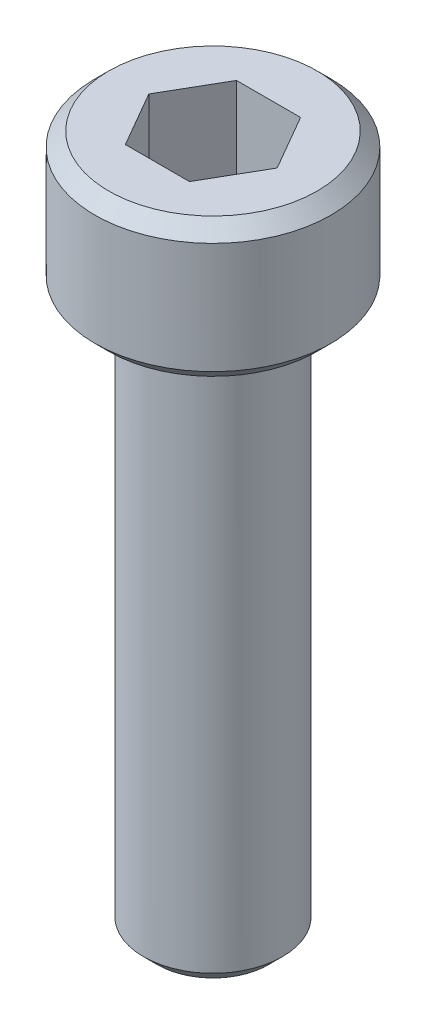
ISO-10303-21;
HEADER;
FILE_DESCRIPTION(('STEP AP214'),'2;1');
FILE_NAME('part.step','',(''),(''),'','','');
FILE_SCHEMA(('AUTOMOTIVE_DESIGN { 1 0 10303 214 1 1 1 1 }'));
ENDSEC;
DATA;
#1=APPLICATION_CONTEXT('core data for automotive mechanical design processes');
#2=APPLICATION_PROTOCOL_DEFINITION('international standard','automotive_design',2000,#1);
#3=PRODUCT_CONTEXT('',#1,'mechanical');
#4=PRODUCT('Part','Part','',(#3));
#5=PRODUCT_RELATED_PRODUCT_CATEGORY('part','',(#4));
#6=PRODUCT_DEFINITION_FORMATION('','',#4);
#7=PRODUCT_DEFINITION_CONTEXT('part definition',#1,'design');
#8=PRODUCT_DEFINITION('design','',#6,#7);
#9=PRODUCT_DEFINITION_SHAPE('','',#8);
#10=(LENGTH_UNIT() NAMED_UNIT(*) SI_UNIT(.MILLI.,.METRE.));
#11=(NAMED_UNIT(*) PLANE_ANGLE_UNIT() SI_UNIT($,.RADIAN.));
#12=(NAMED_UNIT(*) SI_UNIT($,.STERADIAN.) SOLID_ANGLE_UNIT());
#13=UNCERTAINTY_MEASURE_WITH_UNIT(LENGTH_MEASURE(1.E-05),#10,'distance_accuracy_value','');
#14=(GEOMETRIC_REPRESENTATION_CONTEXT(3) GLOBAL_UNCERTAINTY_ASSIGNED_CONTEXT((#13)) GLOBAL_UNIT_ASSIGNED_CONTEXT((#10,
#11,#12)) REPRESENTATION_CONTEXT('',''));
#15=CARTESIAN_POINT('',(0.,0.,0.));
#16=DIRECTION('',(0.,0.,1.));
#17=DIRECTION('',(1.,0.,0.));
#18=AXIS2_PLACEMENT_3D('',#15,#16,#17);
#19=CARTESIAN_POINT('',(2.3094010767585,22.,0.));
#20=DIRECTION('',(0.,1.,0.));
#21=DIRECTION('',(0.,0.,1.));
#22=AXIS2_PLACEMENT_3D('',#19,#20,#21);
#23=PLANE('',#22);
#24=DIRECTION('',(-1.,0.,0.));
#25=VECTOR('',#24,1.);
#26=CARTESIAN_POINT('',(1.15470053837925,22.,-2.));
#27=LINE('',#26,#25);
#28=CARTESIAN_POINT('',(1.15470053837925,22.,-2.));
#29=VERTEX_POINT('',#28);
#30=CARTESIAN_POINT('',(-1.15470053837925,22.,-2.));
#31=VERTEX_POINT('',#30);
#32=EDGE_CURVE('E72',#29,#31,#27,.T.);
#33=ORIENTED_EDGE('',*,*,#32,.T.);
#34=DIRECTION('',(-0.5,0.,0.866025403784439));
#35=VECTOR('',#34,1.);
#36=CARTESIAN_POINT('',(-1.15470053837925,22.,-2.));
#37=LINE('',#36,#35);
#38=CARTESIAN_POINT('',(-2.3094010767585,22.,0.));
#39=VERTEX_POINT('',#38);
#40=EDGE_CURVE('E128',#31,#39,#37,.T.);
#41=ORIENTED_EDGE('',*,*,#40,.T.);
#42=DIRECTION('',(0.5,0.,0.866025403784438));
#43=VECTOR('',#42,1.);
#44=CARTESIAN_POINT('',(-2.3094010767585,22.,0.));
#45=LINE('',#44,#43);
#46=CARTESIAN_POINT('',(-1.15470053837925,22.,2.));
#47=VERTEX_POINT('',#46);
#48=EDGE_CURVE('E133',#39,#47,#45,.T.);
#49=ORIENTED_EDGE('',*,*,#48,.T.);
#50=DIRECTION('',(1.,0.,0.));
#51=VECTOR('',#50,1.);
#52=CARTESIAN_POINT('',(-1.15470053837925,22.,2.));
#53=LINE('',#52,#51);
#54=CARTESIAN_POINT('',(1.15470053837925,22.,2.));
#55=VERTEX_POINT('',#54);
#56=EDGE_CURVE('E137',#47,#55,#53,.T.);
#57=ORIENTED_EDGE('',*,*,#56,.T.);
#58=DIRECTION('',(0.5,0.,-0.866025403784438));
#59=VECTOR('',#58,1.);
#60=CARTESIAN_POINT('',(1.15470053837925,22.,2.));
#61=LINE('',#60,#59);
#62=CARTESIAN_POINT('',(2.3094010767585,22.,0.));
#63=VERTEX_POINT('',#62);
#64=EDGE_CURVE('E68',#55,#63,#61,.T.);
#65=ORIENTED_EDGE('',*,*,#64,.T.);
#66=DIRECTION('',(-0.5,0.,-0.866025403784438));
#67=VECTOR('',#66,1.);
#68=CARTESIAN_POINT('',(2.3094010767585,22.,0.));
#69=LINE('',#68,#67);
#70=EDGE_CURVE('E70',#63,#29,#69,.T.);
#71=ORIENTED_EDGE('',*,*,#70,.T.);
#72=EDGE_LOOP('',(#33,#41,#49,#57,#65,#71));
#73=FACE_BOUND('',#72,.T.);
#74=ADVANCED_FACE('F17',(#73),#23,.T.);
#75=CARTESIAN_POINT('',(1.15470053837925,22.,-2.));
#76=DIRECTION('',(0.,0.,-1.));
#77=DIRECTION('',(-1.,0.,0.));
#78=AXIS2_PLACEMENT_3D('',#75,#76,#77);
#79=PLANE('',#78);
#80=ORIENTED_EDGE('',*,*,#32,.F.);
#81=DIRECTION('',(0.,1.,0.));
#82=VECTOR('',#81,1.);
#83=CARTESIAN_POINT('',(1.15470053837925,22.,-2.));
#84=LINE('',#83,#82);
#85=CARTESIAN_POINT('',(1.15470053837925,25.,-2.));
#86=VERTEX_POINT('',#85);
#87=EDGE_CURVE('E77',#29,#86,#84,.T.);
#88=ORIENTED_EDGE('',*,*,#87,.T.);
#89=DIRECTION('',(1.,0.,0.));
#90=VECTOR('',#89,1.);
#91=CARTESIAN_POINT('',(0.,25.,-2.));
#92=LINE('',#91,#90);
#93=CARTESIAN_POINT('',(-1.15470053837925,25.,-2.));
#94=VERTEX_POINT('',#93);
#95=EDGE_CURVE('E125',#94,#86,#92,.T.);
#96=ORIENTED_EDGE('',*,*,#95,.F.);
#97=DIRECTION('',(0.,1.,0.));
#98=VECTOR('',#97,1.);
#99=CARTESIAN_POINT('',(-1.15470053837925,22.,-2.));
#100=LINE('',#99,#98);
#101=EDGE_CURVE('E83',#94,#31,#100,.F.);
#102=ORIENTED_EDGE('',*,*,#101,.T.);
#103=EDGE_LOOP('',(#80,#88,#96,#102));
#104=FACE_BOUND('',#103,.T.);
#105=ADVANCED_FACE('F80',(#104),#79,.F.);
#106=CARTESIAN_POINT('',(2.3094010767585,22.,0.));
#107=DIRECTION('',(0.866025403784438,0.,-0.5));
#108=DIRECTION('',(-0.5,0.,-0.866025403784438));
#109=AXIS2_PLACEMENT_3D('',#106,#107,#108);
#110=PLANE('',#109);
#111=ORIENTED_EDGE('',*,*,#70,.F.);
#112=DIRECTION('',(0.,1.,0.));
#113=VECTOR('',#112,1.);
#114=CARTESIAN_POINT('',(2.3094010767585,22.,0.));
#115=LINE('',#114,#113);
#116=CARTESIAN_POINT('',(2.3094010767585,25.,0.));
#117=VERTEX_POINT('',#116);
#118=EDGE_CURVE('E91',#63,#117,#115,.T.);
#119=ORIENTED_EDGE('',*,*,#118,.T.);
#120=DIRECTION('',(0.500000000000001,0.,0.866025403784438));
#121=VECTOR('',#120,1.);
#122=CARTESIAN_POINT('',(1.15470053837925,25.,-2.));
#123=LINE('',#122,#121);
#124=EDGE_CURVE('E88',#86,#117,#123,.T.);
#125=ORIENTED_EDGE('',*,*,#124,.F.);
#126=ORIENTED_EDGE('',*,*,#87,.F.);
#127=EDGE_LOOP('',(#111,#119,#125,#126));
#128=FACE_BOUND('',#127,.T.);
#129=ADVANCED_FACE('F86',(#128),#110,.F.);
#130=CARTESIAN_POINT('',(1.15470053837925,22.,2.));
#131=DIRECTION('',(0.866025403784438,0.,0.5));
#132=DIRECTION('',(0.5,0.,-0.866025403784438));
#133=AXIS2_PLACEMENT_3D('',#130,#131,#132);
#134=PLANE('',#133);
#135=ORIENTED_EDGE('',*,*,#64,.F.);
#136=DIRECTION('',(0.,1.,0.));
#137=VECTOR('',#136,1.);
#138=CARTESIAN_POINT('',(1.15470053837925,22.,2.));
#139=LINE('',#138,#137);
#140=CARTESIAN_POINT('',(1.15470053837925,25.,2.));
#141=VERTEX_POINT('',#140);
#142=EDGE_CURVE('E135',#55,#141,#139,.T.);
#143=ORIENTED_EDGE('',*,*,#142,.T.);
#144=DIRECTION('',(-0.5,0.,0.866025403784438));
#145=VECTOR('',#144,1.);
#146=CARTESIAN_POINT('',(2.3094010767585,25.,0.));
#147=LINE('',#146,#145);
#148=EDGE_CURVE('E121',#117,#141,#147,.T.);
#149=ORIENTED_EDGE('',*,*,#148,.F.);
#150=ORIENTED_EDGE('',*,*,#118,.F.);
#151=EDGE_LOOP('',(#135,#143,#149,#150));
#152=FACE_BOUND('',#151,.T.);
#153=ADVANCED_FACE('F140',(#152),#134,.F.);
#154=CARTESIAN_POINT('',(-1.15470053837925,22.,2.));
#155=DIRECTION('',(0.,0.,1.));
#156=DIRECTION('',(1.,0.,0.));
#157=AXIS2_PLACEMENT_3D('',#154,#155,#156);
#158=PLANE('',#157);
#159=ORIENTED_EDGE('',*,*,#56,.F.);
#160=DIRECTION('',(0.,1.,0.));
#161=VECTOR('',#160,1.);
#162=CARTESIAN_POINT('',(-1.15470053837925,22.,2.));
#163=LINE('',#162,#161);
#164=CARTESIAN_POINT('',(-1.15470053837925,25.,2.));
#165=VERTEX_POINT('',#164);
#166=EDGE_CURVE('E131',#47,#165,#163,.T.);
#167=ORIENTED_EDGE('',*,*,#166,.T.);
#168=DIRECTION('',(1.,0.,0.));
#169=VECTOR('',#168,1.);
#170=CARTESIAN_POINT('',(0.,25.,2.));
#171=LINE('',#170,#169);
#172=EDGE_CURVE('E118',#141,#165,#171,.F.);
#173=ORIENTED_EDGE('',*,*,#172,.F.);
#174=ORIENTED_EDGE('',*,*,#142,.F.);
#175=EDGE_LOOP('',(#159,#167,#173,#174));
#176=FACE_BOUND('',#175,.T.);
#177=ADVANCED_FACE('F151',(#176),#158,.F.);
#178=CARTESIAN_POINT('',(-2.3094010767585,22.,0.));
#179=DIRECTION('',(-0.866025403784438,0.,0.5));
#180=DIRECTION('',(0.5,0.,0.866025403784438));
#181=AXIS2_PLACEMENT_3D('',#178,#179,#180);
#182=PLANE('',#181);
#183=ORIENTED_EDGE('',*,*,#48,.F.);
#184=DIRECTION('',(0.,1.,0.));
#185=VECTOR('',#184,1.);
#186=CARTESIAN_POINT('',(-2.3094010767585,22.,0.));
#187=LINE('',#186,#185);
#188=CARTESIAN_POINT('',(-2.3094010767585,25.,0.));
#189=VERTEX_POINT('',#188);
#190=EDGE_CURVE('E35',#39,#189,#187,.T.);
#191=ORIENTED_EDGE('',*,*,#190,.T.);
#192=DIRECTION('',(-0.5,0.,-0.866025403784439));
#193=VECTOR('',#192,1.);
#194=CARTESIAN_POINT('',(-1.15470053837925,25.,2.));
#195=LINE('',#194,#193);
#196=EDGE_CURVE('E115',#165,#189,#195,.T.);
#197=ORIENTED_EDGE('',*,*,#196,.F.);
#198=ORIENTED_EDGE('',*,*,#166,.F.);
#199=EDGE_LOOP('',(#183,#191,#197,#198));
#200=FACE_BOUND('',#199,.T.);
#201=ADVANCED_FACE('F149',(#200),#182,.F.);
#202=CARTESIAN_POINT('',(-1.15470053837925,22.,-2.));
#203=DIRECTION('',(-0.866025403784439,0.,-0.5));
#204=DIRECTION('',(-0.5,0.,0.866025403784439));
#205=AXIS2_PLACEMENT_3D('',#202,#203,#204);
#206=PLANE('',#205);
#207=ORIENTED_EDGE('',*,*,#40,.F.);
#208=ORIENTED_EDGE('',*,*,#101,.F.);
#209=DIRECTION('',(0.5,0.,-0.866025403784439));
#210=VECTOR('',#209,1.);
#211=CARTESIAN_POINT('',(-2.3094010767585,25.,0.));
#212=LINE('',#211,#210);
#213=EDGE_CURVE('E112',#189,#94,#212,.T.);
#214=ORIENTED_EDGE('',*,*,#213,.F.);
#215=ORIENTED_EDGE('',*,*,#190,.F.);
#216=EDGE_LOOP('',(#207,#208,#214,#215));
#217=FACE_BOUND('',#216,.T.);
#218=ADVANCED_FACE('F146',(#217),#206,.F.);
#219=CARTESIAN_POINT('',(0.,25.,-4.25));
#220=DIRECTION('',(0.,1.,0.));
#221=DIRECTION('',(0.,0.,1.));
#222=AXIS2_PLACEMENT_3D('',#219,#220,#221);
#223=PLANE('',#222);
#224=CARTESIAN_POINT('',(0.,25.0000000000341,0.));
#225=DIRECTION('',(0.,-1.,0.));
#226=DIRECTION('',(1.,0.,0.));
#227=AXIS2_PLACEMENT_3D('',#224,#225,#226);
#228=CIRCLE('',#227,3.74999999996817);
#229=CARTESIAN_POINT('',(3.74999999996817,25.0000000000341,0.));
#230=VERTEX_POINT('',#229);
#231=EDGE_CURVE('E20',#230,#230,#228,.T.);
#232=ORIENTED_EDGE('',*,*,#231,.F.);
#233=EDGE_LOOP('',(#232));
#234=FACE_BOUND('',#233,.T.);
#235=ORIENTED_EDGE('',*,*,#196,.T.);
#236=ORIENTED_EDGE('',*,*,#213,.T.);
#237=ORIENTED_EDGE('',*,*,#95,.T.);
#238=ORIENTED_EDGE('',*,*,#124,.T.);
#239=ORIENTED_EDGE('',*,*,#148,.T.);
#240=ORIENTED_EDGE('',*,*,#172,.T.);
#241=EDGE_LOOP('',(#235,#236,#237,#238,#239,#240));
#242=FACE_BOUND('',#241,.T.);
#243=ADVANCED_FACE('F144',(#234,#242),#223,.T.);
#244=CARTESIAN_POINT('',(0.,24.5000000001028,0.));
#245=DIRECTION('',(0.,-1.,0.));
#246=DIRECTION('',(1.,0.,0.));
#247=AXIS2_PLACEMENT_3D('',#244,#245,#246);
#248=CONICAL_SURFACE('',#247,4.2499999998995,0.785398163397448);
#249=CARTESIAN_POINT('',(0.,24.5,0.));
#250=DIRECTION('',(0.,-1.,0.));
#251=DIRECTION('',(0.,0.,-1.));
#252=AXIS2_PLACEMENT_3D('',#249,#250,#251);
#253=CIRCLE('',#252,4.25);
#254=CARTESIAN_POINT('',(0.,24.5,-4.25));
#255=VERTEX_POINT('',#254);
#256=EDGE_CURVE('E105',#255,#255,#253,.T.);
#257=ORIENTED_EDGE('',*,*,#256,.F.);
#258=EDGE_LOOP('',(#257));
#259=FACE_BOUND('',#258,.T.);
#260=ORIENTED_EDGE('',*,*,#231,.T.);
#261=EDGE_LOOP('',(#260));
#262=FACE_BOUND('',#261,.T.);
#263=ADVANCED_FACE('F186',(#259,#262),#248,.T.);
#264=CARTESIAN_POINT('',(0.,0.,0.));
#265=DIRECTION('',(0.,-1.,0.));
#266=DIRECTION('',(0.,0.,-1.));
#267=AXIS2_PLACEMENT_3D('',#264,#265,#266);
#268=CYLINDRICAL_SURFACE('',#267,4.25);
#269=CARTESIAN_POINT('',(0.,20.49999999997,0.));
#270=DIRECTION('',(0.,1.,0.));
#271=DIRECTION('',(0.,0.,1.));
#272=AXIS2_PLACEMENT_3D('',#269,#270,#271);
#273=CIRCLE('',#272,4.25000000001319);
#274=CARTESIAN_POINT('',(0.,20.49999999997,4.25000000001319));
#275=VERTEX_POINT('',#274);
#276=EDGE_CURVE('E101',#275,#275,#273,.F.);
#277=ORIENTED_EDGE('',*,*,#276,.F.);
#278=EDGE_LOOP('',(#277));
#279=FACE_BOUND('',#278,.T.);
#280=ORIENTED_EDGE('',*,*,#256,.T.);
#281=EDGE_LOOP('',(#280));
#282=FACE_BOUND('',#281,.T.);
#283=ADVANCED_FACE('F183',(#279,#282),#268,.T.);
#284=CARTESIAN_POINT('',(0.,20.4999999998563,0.));
#285=DIRECTION('',(0.,1.,0.));
#286=DIRECTION('',(0.,0.,1.));
#287=AXIS2_PLACEMENT_3D('',#284,#285,#286);
#288=CONICAL_SURFACE('',#287,4.2499999998995,0.785398163397448);
#289=ORIENTED_EDGE('',*,*,#276,.T.);
#290=EDGE_LOOP('',(#289));
#291=FACE_BOUND('',#290,.T.);
#292=CARTESIAN_POINT('',(0.,19.999999999925,0.));
#293=DIRECTION('',(0.,1.,0.));
#294=DIRECTION('',(0.,0.,1.));
#295=AXIS2_PLACEMENT_3D('',#292,#293,#294);
#296=CIRCLE('',#295,3.74999999996817);
#297=CARTESIAN_POINT('',(0.,19.999999999925,3.74999999996817));
#298=VERTEX_POINT('',#297);
#299=EDGE_CURVE('E99',#298,#298,#296,.F.);
#300=ORIENTED_EDGE('',*,*,#299,.F.);
#301=EDGE_LOOP('',(#300));
#302=FACE_BOUND('',#301,.T.);
#303=ADVANCED_FACE('F179',(#291,#302),#288,.T.);
#304=CARTESIAN_POINT('',(0.,0.,0.));
#305=DIRECTION('',(0.,-1.,0.));
#306=DIRECTION('',(0.,0.,-1.));
#307=AXIS2_PLACEMENT_3D('',#304,#305,#306);
#308=PLANE('',#307);
#309=CARTESIAN_POINT('',(0.,0.,0.));
#310=DIRECTION('',(0.,1.,0.));
#311=DIRECTION('',(0.,0.,1.));
#312=AXIS2_PLACEMENT_3D('',#309,#310,#311);
#313=CIRCLE('',#312,1.99999999995271);
#314=CARTESIAN_POINT('',(0.,0.,1.99999999995271));
#315=VERTEX_POINT('',#314);
#316=EDGE_CURVE('E97',#315,#315,#313,.T.);
#317=ORIENTED_EDGE('',*,*,#316,.F.);
#318=EDGE_LOOP('',(#317));
#319=FACE_BOUND('',#318,.T.);
#320=ADVANCED_FACE('F176',(#319),#308,.T.);
#321=CARTESIAN_POINT('',(0.,20.,-2.5));
#322=DIRECTION('',(0.,-1.,0.));
#323=DIRECTION('',(0.,0.,-1.));
#324=AXIS2_PLACEMENT_3D('',#321,#322,#323);
#325=PLANE('',#324);
#326=ORIENTED_EDGE('',*,*,#299,.T.);
#327=EDGE_LOOP('',(#326));
#328=FACE_BOUND('',#327,.T.);
#329=CARTESIAN_POINT('',(0.,20.,0.));
#330=DIRECTION('',(0.,-1.,0.));
#331=DIRECTION('',(0.,0.,-1.));
#332=AXIS2_PLACEMENT_3D('',#329,#330,#331);
#333=CIRCLE('',#332,2.5);
#334=CARTESIAN_POINT('',(0.,20.,-2.5));
#335=VERTEX_POINT('',#334);
#336=EDGE_CURVE('E26',#335,#335,#333,.T.);
#337=ORIENTED_EDGE('',*,*,#336,.F.);
#338=EDGE_LOOP('',(#337));
#339=FACE_BOUND('',#338,.T.);
#340=ADVANCED_FACE('F169',(#328,#339),#325,.T.);
#341=CARTESIAN_POINT('',(0.,0.499999999988177,0.));
#342=DIRECTION('',(0.,1.,0.));
#343=DIRECTION('',(0.,0.,1.));
#344=AXIS2_PLACEMENT_3D('',#341,#342,#343);
#345=CONICAL_SURFACE('',#344,2.49999999999773,0.785398163454292);
#346=CARTESIAN_POINT('',(0.,0.500000000000007,0.));
#347=DIRECTION('',(0.,-1.,0.));
#348=DIRECTION('',(0.,0.,-1.));
#349=AXIS2_PLACEMENT_3D('',#346,#347,#348);
#350=CIRCLE('',#349,2.5);
#351=CARTESIAN_POINT('',(0.,0.500000000000007,-2.5));
#352=VERTEX_POINT('',#351);
#353=EDGE_CURVE('E11',#352,#352,#350,.F.);
#354=ORIENTED_EDGE('',*,*,#353,.F.);
#355=EDGE_LOOP('',(#354));
#356=FACE_BOUND('',#355,.T.);
#357=ORIENTED_EDGE('',*,*,#316,.T.);
#358=EDGE_LOOP('',(#357));
#359=FACE_BOUND('',#358,.T.);
#360=ADVANCED_FACE('F163',(#356,#359),#345,.T.);
#361=CARTESIAN_POINT('',(0.,0.,0.));
#362=DIRECTION('',(0.,-1.,0.));
#363=DIRECTION('',(0.,0.,-1.));
#364=AXIS2_PLACEMENT_3D('',#361,#362,#363);
#365=CYLINDRICAL_SURFACE('',#364,2.5);
#366=ORIENTED_EDGE('',*,*,#353,.T.);
#367=EDGE_LOOP('',(#366));
#368=FACE_BOUND('',#367,.T.);
#369=ORIENTED_EDGE('',*,*,#336,.T.);
#370=EDGE_LOOP('',(#369));
#371=FACE_BOUND('',#370,.T.);
#372=ADVANCED_FACE('F161',(#368,#371),#365,.T.);
#373=CLOSED_SHELL('',(#74,#105,#129,#153,#177,#201,#218,#243,#263,#283,#303,#320,#340,#360,#372));
#374=MANIFOLD_SOLID_BREP('B1',#373);
#375=ADVANCED_BREP_SHAPE_REPRESENTATION('',(#18,#374),#14);
#376=SHAPE_DEFINITION_REPRESENTATION(#9,#375);
ENDSEC;
END-ISO-10303-21;
